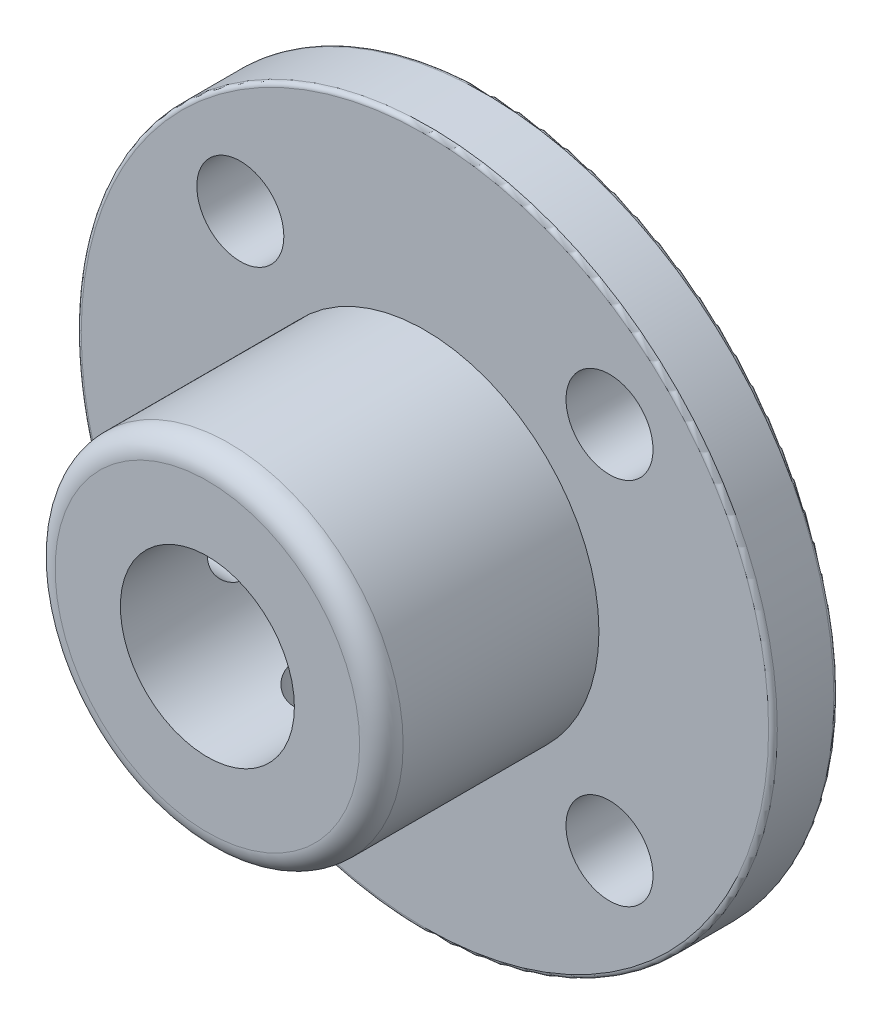
ISO-10303-21;
HEADER;
FILE_DESCRIPTION(('STEP AP214'),'2;1');
FILE_NAME('part.step','',(''),(''),'','','');
FILE_SCHEMA(('AUTOMOTIVE_DESIGN { 1 0 10303 214 1 1 1 1 }'));
ENDSEC;
DATA;
#1=APPLICATION_CONTEXT('core data for automotive mechanical design processes');
#2=APPLICATION_PROTOCOL_DEFINITION('international standard','automotive_design',2000,#1);
#3=PRODUCT_CONTEXT('',#1,'mechanical');
#4=PRODUCT('Part','Part','',(#3));
#5=PRODUCT_RELATED_PRODUCT_CATEGORY('part','',(#4));
#6=PRODUCT_DEFINITION_FORMATION('','',#4);
#7=PRODUCT_DEFINITION_CONTEXT('part definition',#1,'design');
#8=PRODUCT_DEFINITION('design','',#6,#7);
#9=PRODUCT_DEFINITION_SHAPE('','',#8);
#10=(LENGTH_UNIT() NAMED_UNIT(*) SI_UNIT(.MILLI.,.METRE.));
#11=(NAMED_UNIT(*) PLANE_ANGLE_UNIT() SI_UNIT($,.RADIAN.));
#12=(NAMED_UNIT(*) SI_UNIT($,.STERADIAN.) SOLID_ANGLE_UNIT());
#13=UNCERTAINTY_MEASURE_WITH_UNIT(LENGTH_MEASURE(1.E-05),#10,'distance_accuracy_value','');
#14=(GEOMETRIC_REPRESENTATION_CONTEXT(3) GLOBAL_UNCERTAINTY_ASSIGNED_CONTEXT((#13)) GLOBAL_UNIT_ASSIGNED_CONTEXT((#10,
#11,#12)) REPRESENTATION_CONTEXT('',''));
#15=CARTESIAN_POINT('',(0.,0.,0.));
#16=DIRECTION('',(0.,0.,1.));
#17=DIRECTION('',(1.,0.,0.));
#18=AXIS2_PLACEMENT_3D('',#15,#16,#17);
#19=CARTESIAN_POINT('',(0.,0.,3.));
#20=DIRECTION('',(0.,0.,-1.));
#21=DIRECTION('',(-1.,0.,0.));
#22=AXIS2_PLACEMENT_3D('',#19,#20,#21);
#23=CYLINDRICAL_SURFACE('',#22,16.);
#24=CARTESIAN_POINT('',(0.,0.,0.2));
#25=DIRECTION('',(0.,0.,1.));
#26=DIRECTION('',(1.,0.,0.));
#27=AXIS2_PLACEMENT_3D('',#24,#25,#26);
#28=CIRCLE('',#27,16.);
#29=CARTESIAN_POINT('',(16.,0.,0.2));
#30=VERTEX_POINT('',#29);
#31=EDGE_CURVE('E44',#30,#30,#28,.T.);
#32=ORIENTED_EDGE('',*,*,#31,.T.);
#33=EDGE_LOOP('',(#32));
#34=FACE_BOUND('',#33,.T.);
#35=CARTESIAN_POINT('',(0.,0.,2.8));
#36=DIRECTION('',(0.,0.,1.));
#37=DIRECTION('',(1.,0.,0.));
#38=AXIS2_PLACEMENT_3D('',#35,#36,#37);
#39=CIRCLE('',#38,16.);
#40=CARTESIAN_POINT('',(16.,0.,2.8));
#41=VERTEX_POINT('',#40);
#42=EDGE_CURVE('E48',#41,#41,#39,.F.);
#43=ORIENTED_EDGE('',*,*,#42,.T.);
#44=EDGE_LOOP('',(#43));
#45=FACE_BOUND('',#44,.T.);
#46=ADVANCED_FACE('F33',(#34,#45),#23,.T.);
#47=CARTESIAN_POINT('',(0.,0.,3.));
#48=DIRECTION('',(0.,0.,1.));
#49=DIRECTION('',(1.,0.,0.));
#50=AXIS2_PLACEMENT_3D('',#47,#48,#49);
#51=PLANE('',#50);
#52=CARTESIAN_POINT('',(0.,0.,3.));
#53=DIRECTION('',(0.,0.,1.));
#54=DIRECTION('',(1.,0.,0.));
#55=AXIS2_PLACEMENT_3D('',#52,#53,#54);
#56=CIRCLE('',#55,15.8);
#57=CARTESIAN_POINT('',(15.8,0.,3.));
#58=VERTEX_POINT('',#57);
#59=EDGE_CURVE('E10',#58,#58,#56,.T.);
#60=ORIENTED_EDGE('',*,*,#59,.T.);
#61=EDGE_LOOP('',(#60));
#62=FACE_BOUND('',#61,.T.);
#63=CARTESIAN_POINT('',(-8.48528137423857,-8.48528137423857,3.));
#64=DIRECTION('',(0.,0.,1.));
#65=DIRECTION('',(1.,0.,0.));
#66=AXIS2_PLACEMENT_3D('',#63,#64,#65);
#67=CIRCLE('',#66,2.);
#68=CARTESIAN_POINT('',(-6.48528137423857,-8.48528137423857,3.));
#69=VERTEX_POINT('',#68);
#70=EDGE_CURVE('E272',#69,#69,#67,.T.);
#71=ORIENTED_EDGE('',*,*,#70,.F.);
#72=EDGE_LOOP('',(#71));
#73=FACE_BOUND('',#72,.T.);
#74=CARTESIAN_POINT('',(8.48528137423857,-8.48528137423857,3.));
#75=DIRECTION('',(0.,0.,1.));
#76=DIRECTION('',(1.,0.,0.));
#77=AXIS2_PLACEMENT_3D('',#74,#75,#76);
#78=CIRCLE('',#77,2.);
#79=CARTESIAN_POINT('',(10.4852813742386,-8.48528137423857,3.));
#80=VERTEX_POINT('',#79);
#81=EDGE_CURVE('E278',#80,#80,#78,.T.);
#82=ORIENTED_EDGE('',*,*,#81,.F.);
#83=EDGE_LOOP('',(#82));
#84=FACE_BOUND('',#83,.T.);
#85=CARTESIAN_POINT('',(8.48528137423857,8.48528137423857,3.));
#86=DIRECTION('',(0.,0.,1.));
#87=DIRECTION('',(1.,0.,0.));
#88=AXIS2_PLACEMENT_3D('',#85,#86,#87);
#89=CIRCLE('',#88,2.);
#90=CARTESIAN_POINT('',(10.4852813742386,8.48528137423857,3.));
#91=VERTEX_POINT('',#90);
#92=EDGE_CURVE('E245',#91,#91,#89,.T.);
#93=ORIENTED_EDGE('',*,*,#92,.F.);
#94=EDGE_LOOP('',(#93));
#95=FACE_BOUND('',#94,.T.);
#96=CARTESIAN_POINT('',(-8.48528137423857,8.48528137423857,3.));
#97=DIRECTION('',(0.,0.,1.));
#98=DIRECTION('',(1.,0.,0.));
#99=AXIS2_PLACEMENT_3D('',#96,#97,#98);
#100=CIRCLE('',#99,2.);
#101=CARTESIAN_POINT('',(-6.48528137423857,8.48528137423857,3.));
#102=VERTEX_POINT('',#101);
#103=EDGE_CURVE('E238',#102,#102,#100,.T.);
#104=ORIENTED_EDGE('',*,*,#103,.F.);
#105=EDGE_LOOP('',(#104));
#106=FACE_BOUND('',#105,.T.);
#107=CARTESIAN_POINT('',(0.,0.,3.));
#108=DIRECTION('',(0.,0.,1.));
#109=DIRECTION('',(1.,0.,0.));
#110=AXIS2_PLACEMENT_3D('',#107,#108,#109);
#111=CIRCLE('',#110,8.);
#112=CARTESIAN_POINT('',(8.,0.,3.));
#113=VERTEX_POINT('',#112);
#114=EDGE_CURVE('E251',#113,#113,#111,.T.);
#115=ORIENTED_EDGE('',*,*,#114,.F.);
#116=EDGE_LOOP('',(#115));
#117=FACE_BOUND('',#116,.T.);
#118=ADVANCED_FACE('F101',(#62,#73,#84,#95,#106,#117),#51,.T.);
#119=CARTESIAN_POINT('',(0.,0.,0.));
#120=DIRECTION('',(0.,0.,1.));
#121=DIRECTION('',(1.,0.,0.));
#122=AXIS2_PLACEMENT_3D('',#119,#120,#121);
#123=PLANE('',#122);
#124=CARTESIAN_POINT('',(0.,0.,0.));
#125=DIRECTION('',(0.,0.,1.));
#126=DIRECTION('',(1.,0.,0.));
#127=AXIS2_PLACEMENT_3D('',#124,#125,#126);
#128=CIRCLE('',#127,15.8);
#129=CARTESIAN_POINT('',(15.8,0.,0.));
#130=VERTEX_POINT('',#129);
#131=EDGE_CURVE('E40',#130,#130,#128,.F.);
#132=ORIENTED_EDGE('',*,*,#131,.T.);
#133=EDGE_LOOP('',(#132));
#134=FACE_BOUND('',#133,.T.);
#135=CARTESIAN_POINT('',(-8.48528137423857,-8.48528137423857,0.));
#136=DIRECTION('',(0.,0.,1.));
#137=DIRECTION('',(1.,0.,0.));
#138=AXIS2_PLACEMENT_3D('',#135,#136,#137);
#139=CIRCLE('',#138,2.);
#140=CARTESIAN_POINT('',(-6.48528137423857,-8.48528137423857,0.));
#141=VERTEX_POINT('',#140);
#142=EDGE_CURVE('E275',#141,#141,#139,.T.);
#143=ORIENTED_EDGE('',*,*,#142,.T.);
#144=EDGE_LOOP('',(#143));
#145=FACE_BOUND('',#144,.T.);
#146=CARTESIAN_POINT('',(8.48528137423857,-8.48528137423857,0.));
#147=DIRECTION('',(0.,0.,1.));
#148=DIRECTION('',(1.,0.,0.));
#149=AXIS2_PLACEMENT_3D('',#146,#147,#148);
#150=CIRCLE('',#149,2.);
#151=CARTESIAN_POINT('',(10.4852813742386,-8.48528137423857,0.));
#152=VERTEX_POINT('',#151);
#153=EDGE_CURVE('E281',#152,#152,#150,.T.);
#154=ORIENTED_EDGE('',*,*,#153,.T.);
#155=EDGE_LOOP('',(#154));
#156=FACE_BOUND('',#155,.T.);
#157=CARTESIAN_POINT('',(8.48528137423857,8.48528137423857,0.));
#158=DIRECTION('',(0.,0.,1.));
#159=DIRECTION('',(1.,0.,0.));
#160=AXIS2_PLACEMENT_3D('',#157,#158,#159);
#161=CIRCLE('',#160,2.);
#162=CARTESIAN_POINT('',(10.4852813742386,8.48528137423857,0.));
#163=VERTEX_POINT('',#162);
#164=EDGE_CURVE('E240',#163,#163,#161,.T.);
#165=ORIENTED_EDGE('',*,*,#164,.T.);
#166=EDGE_LOOP('',(#165));
#167=FACE_BOUND('',#166,.T.);
#168=CARTESIAN_POINT('',(-8.48528137423857,8.48528137423857,0.));
#169=DIRECTION('',(0.,0.,1.));
#170=DIRECTION('',(1.,0.,0.));
#171=AXIS2_PLACEMENT_3D('',#168,#169,#170);
#172=CIRCLE('',#171,2.);
#173=CARTESIAN_POINT('',(-6.48528137423857,8.48528137423857,0.));
#174=VERTEX_POINT('',#173);
#175=EDGE_CURVE('E235',#174,#174,#172,.T.);
#176=ORIENTED_EDGE('',*,*,#175,.T.);
#177=EDGE_LOOP('',(#176));
#178=FACE_BOUND('',#177,.T.);
#179=CARTESIAN_POINT('',(0.,0.,0.));
#180=DIRECTION('',(0.,0.,1.));
#181=DIRECTION('',(1.,0.,0.));
#182=AXIS2_PLACEMENT_3D('',#179,#180,#181);
#183=CIRCLE('',#182,4.);
#184=CARTESIAN_POINT('',(4.,0.,0.));
#185=VERTEX_POINT('',#184);
#186=EDGE_CURVE('E248',#185,#185,#183,.T.);
#187=ORIENTED_EDGE('',*,*,#186,.T.);
#188=EDGE_LOOP('',(#187));
#189=FACE_BOUND('',#188,.T.);
#190=ADVANCED_FACE('F99',(#134,#145,#156,#167,#178,#189),#123,.F.);
#191=CARTESIAN_POINT('',(0.,0.,13.));
#192=DIRECTION('',(0.,0.,-1.));
#193=DIRECTION('',(-1.,0.,0.));
#194=AXIS2_PLACEMENT_3D('',#191,#192,#193);
#195=CYLINDRICAL_SURFACE('',#194,8.);
#196=CARTESIAN_POINT('',(0.,-8.,9.));
#197=CARTESIAN_POINT('',(0.0834717464654709,-7.99999848833852,8.99999681041172));
#198=CARTESIAN_POINT('',(0.166984992730099,-7.99868009921714,8.99300892338062));
#199=CARTESIAN_POINT('',(0.331658129841797,-7.9935478589052,8.96526000488165));
#200=CARTESIAN_POINT('',(0.412815974152225,-7.98973190166897,8.94448734936027));
#201=CARTESIAN_POINT('',(0.570372961851801,-7.98003138765458,8.88982729874066));
#202=CARTESIAN_POINT('',(0.646776330685344,-7.97414869946483,8.85595174754746));
#203=CARTESIAN_POINT('',(0.792807973094007,-7.96095710599783,8.77608112307718));
#204=CARTESIAN_POINT('',(0.862436794477323,-7.9536483161829,8.73008703085518));
#205=CARTESIAN_POINT('',(0.993783715930502,-7.93831336430504,8.62670023199632));
#206=CARTESIAN_POINT('',(1.05540895503183,-7.93028034856351,8.56919055532986));
#207=CARTESIAN_POINT('',(1.16819606135369,-7.9144531845865,8.44465669091244));
#208=CARTESIAN_POINT('',(1.21935717689241,-7.90665905354527,8.37763182023071));
#209=CARTESIAN_POINT('',(1.31014998665793,-7.89212551245005,8.23531391163603));
#210=CARTESIAN_POINT('',(1.34968721969605,-7.88539493886182,8.15995962968276));
#211=CARTESIAN_POINT('',(1.41550524332283,-7.87384713211987,8.00353108482321));
#212=CARTESIAN_POINT('',(1.44178717713098,-7.86902973396962,7.92245731588878));
#213=CARTESIAN_POINT('',(1.480050535035,-7.8619226957455,7.75788476908559));
#214=CARTESIAN_POINT('',(1.49219390192039,-7.85960445366405,7.67442490279654));
#215=CARTESIAN_POINT('',(1.50233808095346,-7.85767197152761,7.50662261519175));
#216=CARTESIAN_POINT('',(1.50034016135374,-7.8580574889876,7.4222802736977));
#217=CARTESIAN_POINT('',(1.48238979602362,-7.86146292701753,7.25628047473395));
#218=CARTESIAN_POINT('',(1.46662149996045,-7.86444808147334,7.17460228569985));
#219=CARTESIAN_POINT('',(1.42186799396207,-7.87266183284666,7.01507158021739));
#220=CARTESIAN_POINT('',(1.39288222239499,-7.87789052509516,6.9372192264907));
#221=CARTESIAN_POINT('',(1.322336471793,-7.89003855292588,6.78701132099974));
#222=CARTESIAN_POINT('',(1.28070213532456,-7.89696783823366,6.71469152941919));
#223=CARTESIAN_POINT('',(1.18609368930416,-7.91172971602918,6.57799527145977));
#224=CARTESIAN_POINT('',(1.13311842889266,-7.91956240015522,6.5136196122852));
#225=CARTESIAN_POINT('',(1.01633905685298,-7.93540001272164,6.39357504432754));
#226=CARTESIAN_POINT('',(0.952377436860683,-7.9434057102403,6.33805934754826));
#227=CARTESIAN_POINT('',(0.815968037098827,-7.95857386108318,6.23852275932459));
#228=CARTESIAN_POINT('',(0.74352017225577,-7.96573630595245,6.19450198312958));
#229=CARTESIAN_POINT('',(0.592034988874669,-7.97842539677509,6.11918224612998));
#230=CARTESIAN_POINT('',(0.512989564446494,-7.98394999136289,6.0878992208821));
#231=CARTESIAN_POINT('',(0.350639115398697,-7.99272505402719,6.03909790690784));
#232=CARTESIAN_POINT('',(0.267334544277787,-7.99597576367994,6.02157815595464));
#233=CARTESIAN_POINT('',(0.100148652903386,-7.99980360641981,6.00101396898173));
#234=CARTESIAN_POINT('',(0.0162940126341359,-8.00041950912279,5.99775960847027));
#235=CARTESIAN_POINT('',(-0.150761248092183,-7.99901543598228,6.00525547954765));
#236=CARTESIAN_POINT('',(-0.233961900480385,-7.99699558964431,6.01600502306526));
#237=CARTESIAN_POINT('',(-0.396681573218217,-7.99057111500406,6.05102903518337));
#238=CARTESIAN_POINT('',(-0.476224261046063,-7.98618522374031,6.07519728253781));
#239=CARTESIAN_POINT('',(-0.630128631824633,-7.97551842212498,6.13625770677879));
#240=CARTESIAN_POINT('',(-0.704489962595103,-7.96923738311334,6.17315074756578));
#241=CARTESIAN_POINT('',(-0.846816671513214,-7.95538030357666,6.25907812815951));
#242=CARTESIAN_POINT('',(-0.914703277015121,-7.94779086174563,6.30824073853684));
#243=CARTESIAN_POINT('',(-1.04133832326455,-7.93219343489712,6.41713813736236));
#244=CARTESIAN_POINT('',(-1.10008590976087,-7.92418541084687,6.47687391300133));
#245=CARTESIAN_POINT('',(-1.20757295872048,-7.9085247569745,6.60617231891143));
#246=CARTESIAN_POINT('',(-1.25616916218577,-7.90087825860257,6.67585490812539));
#247=CARTESIAN_POINT('',(-1.34096675057787,-7.88692985578532,6.82251762452375));
#248=CARTESIAN_POINT('',(-1.37716859613924,-7.8806279013735,6.89949748037047));
#249=CARTESIAN_POINT('',(-1.43594673512823,-7.87013024209574,7.05820586724254));
#250=CARTESIAN_POINT('',(-1.45858868794786,-7.86592440436878,7.13990937955933));
#251=CARTESIAN_POINT('',(-1.48980679326235,-7.86007203802415,7.3060472225214));
#252=CARTESIAN_POINT('',(-1.49838453270708,-7.8584252206579,7.3904812439704));
#253=CARTESIAN_POINT('',(-1.50117762148355,-7.85789199803857,7.55824833144151));
#254=CARTESIAN_POINT('',(-1.49561895003499,-7.85896215974293,7.64157758095699));
#255=CARTESIAN_POINT('',(-1.47079175378803,-7.86364600659998,7.80609142204529));
#256=CARTESIAN_POINT('',(-1.45152331089332,-7.86725967655747,7.88727602642744));
#257=CARTESIAN_POINT('',(-1.39991887583263,-7.8766050802318,8.04507448479548));
#258=CARTESIAN_POINT('',(-1.36760735397252,-7.88233284594965,8.12169659134577));
#259=CARTESIAN_POINT('',(-1.29085868912204,-7.8952638755184,8.26846825424084));
#260=CARTESIAN_POINT('',(-1.24642068948186,-7.90246724360119,8.33861735284478));
#261=CARTESIAN_POINT('',(-1.14589487339535,-7.91767266107745,8.4715836800423));
#262=CARTESIAN_POINT('',(-1.08964259864303,-7.92568505353043,8.5342754125671));
#263=CARTESIAN_POINT('',(-0.96742792674229,-7.94152833918735,8.64940516246452));
#264=CARTESIAN_POINT('',(-0.901463301891615,-7.94935919027328,8.70184082098014));
#265=CARTESIAN_POINT('',(-0.760984945071872,-7.96403975968049,8.79541095262706));
#266=CARTESIAN_POINT('',(-0.686399590640516,-7.97088000990561,8.83643942849064));
#267=CARTESIAN_POINT('',(-0.531290113653833,-7.98271619380687,8.90531763660514));
#268=CARTESIAN_POINT('',(-0.450771651705247,-7.98771385879037,8.93317974704691));
#269=CARTESIAN_POINT('',(-0.308347202825153,-7.99428290707632,8.96927731441867));
#270=CARTESIAN_POINT('',(-0.24727381025187,-7.99641470878206,8.9807786303128));
#271=CARTESIAN_POINT('',(-0.124141247115158,-7.9992737995401,8.99614106211645));
#272=CARTESIAN_POINT('',(-0.0620821016527095,-8.00000112429805,9.00000237225591));
#273=CARTESIAN_POINT('',(0.,-8.,9.));
#274=B_SPLINE_CURVE_WITH_KNOTS('',3,(#196,#197,#198,#199,#200,#201,#202,#203,#204,#205,#206,
#207,#208,#209,#210,#211,#212,#213,#214,#215,#216,#217,#218,#219,#220,#221,#222,#223,#224,#225,
#226,#227,#228,#229,#230,#231,#232,#233,#234,#235,#236,#237,#238,#239,#240,#241,#242,#243,#244,
#245,#246,#247,#248,#249,#250,#251,#252,#253,#254,#255,#256,#257,#258,#259,#260,#261,#262,#263,
#264,#265,#266,#267,#268,#269,#270,#271,#272,#273),.UNSPECIFIED.,.T.,.F.,(4,2,2,2,2,2,2,2,2,2,2,
2,2,2,2,2,2,2,2,2,2,2,2,2,2,2,2,2,2,2,2,2,2,2,2,2,2,2,4),(0.,0.250188200964924,
0.500587642535452,0.750761271230907,1.00091465336891,1.2537511801363,1.50660586283617,
1.76146190504357,2.01629596311948,2.26818151445336,2.52004447587256,2.76859000612765,
3.01714609846786,3.2671926262953,3.51726454049859,3.77127768464077,4.02529337544948,
4.27962588321699,4.53393136673745,4.78448174076097,5.03501980464583,5.28360233907828,
5.53220175338032,5.78351778017708,6.03485728413098,6.28953436987299,6.54420198954945,
6.79762627818559,7.05102196946513,7.30039252231748,7.54976158541506,7.79866496207692,
8.04758592655423,8.3002336996638,8.55293951262255,8.80792048916315,9.06266126931173,
9.24874344524409,9.43482089039541),.UNSPECIFIED.);
#275=CARTESIAN_POINT('',(0.,-8.,9.));
#276=VERTEX_POINT('',#275);
#277=EDGE_CURVE('E62',#276,#276,#274,.T.);
#278=ORIENTED_EDGE('',*,*,#277,.T.);
#279=EDGE_LOOP('',(#278));
#280=FACE_BOUND('',#279,.T.);
#281=CARTESIAN_POINT('',(-8.,0.,9.));
#282=CARTESIAN_POINT('',(-7.99999848833852,-0.0834717464654709,8.99999681041172));
#283=CARTESIAN_POINT('',(-7.99868009921714,-0.166984992730099,8.99300892338062));
#284=CARTESIAN_POINT('',(-7.9935478589052,-0.331658129841798,8.96526000488165));
#285=CARTESIAN_POINT('',(-7.98973190166897,-0.412815974152226,8.94448734936027));
#286=CARTESIAN_POINT('',(-7.98003138765458,-0.570372961851802,8.88982729874066));
#287=CARTESIAN_POINT('',(-7.97414869946483,-0.646776330685345,8.85595174754746));
#288=CARTESIAN_POINT('',(-7.96095710599783,-0.792807973094008,8.77608112307718));
#289=CARTESIAN_POINT('',(-7.9536483161829,-0.862436794477324,8.73008703085518));
#290=CARTESIAN_POINT('',(-7.93831336430504,-0.993783715930504,8.62670023199632));
#291=CARTESIAN_POINT('',(-7.93028034856351,-1.05540895503183,8.56919055532986));
#292=CARTESIAN_POINT('',(-7.9144531845865,-1.16819606135369,8.44465669091244));
#293=CARTESIAN_POINT('',(-7.90665905354527,-1.21935717689242,8.37763182023071));
#294=CARTESIAN_POINT('',(-7.89212551245005,-1.31014998665793,8.23531391163603));
#295=CARTESIAN_POINT('',(-7.88539493886182,-1.34968721969606,8.15995962968276));
#296=CARTESIAN_POINT('',(-7.87384713211987,-1.41550524332283,8.00353108482321));
#297=CARTESIAN_POINT('',(-7.86902973396962,-1.44178717713098,7.92245731588878));
#298=CARTESIAN_POINT('',(-7.8619226957455,-1.480050535035,7.75788476908559));
#299=CARTESIAN_POINT('',(-7.85960445366405,-1.49219390192039,7.67442490279653));
#300=CARTESIAN_POINT('',(-7.85767197152761,-1.50233808095347,7.50662261519175));
#301=CARTESIAN_POINT('',(-7.8580574889876,-1.50034016135374,7.4222802736977));
#302=CARTESIAN_POINT('',(-7.86146292701753,-1.48238979602363,7.25628047473395));
#303=CARTESIAN_POINT('',(-7.86444808147334,-1.46662149996045,7.17460228569985));
#304=CARTESIAN_POINT('',(-7.87266183284666,-1.42186799396207,7.01507158021739));
#305=CARTESIAN_POINT('',(-7.87789052509516,-1.392882222395,6.9372192264907));
#306=CARTESIAN_POINT('',(-7.89003855292588,-1.322336471793,6.78701132099974));
#307=CARTESIAN_POINT('',(-7.89696783823366,-1.28070213532456,6.71469152941919));
#308=CARTESIAN_POINT('',(-7.91172971602918,-1.18609368930416,6.57799527145977));
#309=CARTESIAN_POINT('',(-7.91956240015522,-1.13311842889266,6.5136196122852));
#310=CARTESIAN_POINT('',(-7.93540001272164,-1.01633905685298,6.39357504432754));
#311=CARTESIAN_POINT('',(-7.94340571024031,-0.952377436860685,6.33805934754826));
#312=CARTESIAN_POINT('',(-7.95857386108318,-0.815968037098829,6.23852275932459));
#313=CARTESIAN_POINT('',(-7.96573630595245,-0.743520172255772,6.19450198312958));
#314=CARTESIAN_POINT('',(-7.97842539677509,-0.592034988874671,6.11918224612998));
#315=CARTESIAN_POINT('',(-7.98394999136289,-0.512989564446497,6.0878992208821));
#316=CARTESIAN_POINT('',(-7.99272505402719,-0.350639115398699,6.03909790690784));
#317=CARTESIAN_POINT('',(-7.99597576367994,-0.26733454427779,6.02157815595464));
#318=CARTESIAN_POINT('',(-7.99980360641981,-0.100148652903388,6.00101396898173));
#319=CARTESIAN_POINT('',(-8.00041950912279,-0.0162940126341377,5.99775960847027));
#320=CARTESIAN_POINT('',(-7.99901543598228,0.150761248092182,6.00525547954765));
#321=CARTESIAN_POINT('',(-7.99699558964431,0.233961900480383,6.01600502306526));
#322=CARTESIAN_POINT('',(-7.99057111500406,0.396681573218215,6.05102903518337));
#323=CARTESIAN_POINT('',(-7.98618522374031,0.476224261046061,6.07519728253781));
#324=CARTESIAN_POINT('',(-7.97551842212498,0.630128631824631,6.13625770677878));
#325=CARTESIAN_POINT('',(-7.96923738311334,0.704489962595101,6.17315074756578));
#326=CARTESIAN_POINT('',(-7.95538030357666,0.846816671513212,6.25907812815951));
#327=CARTESIAN_POINT('',(-7.94779086174563,0.914703277015119,6.30824073853684));
#328=CARTESIAN_POINT('',(-7.93219343489712,1.04133832326454,6.41713813736236));
#329=CARTESIAN_POINT('',(-7.92418541084687,1.10008590976086,6.47687391300133));
#330=CARTESIAN_POINT('',(-7.9085247569745,1.20757295872048,6.60617231891142));
#331=CARTESIAN_POINT('',(-7.90087825860257,1.25616916218576,6.67585490812538));
#332=CARTESIAN_POINT('',(-7.88692985578532,1.34096675057787,6.82251762452375));
#333=CARTESIAN_POINT('',(-7.8806279013735,1.37716859613924,6.89949748037047));
#334=CARTESIAN_POINT('',(-7.87013024209574,1.43594673512823,7.05820586724254));
#335=CARTESIAN_POINT('',(-7.86592440436878,1.45858868794786,7.13990937955933));
#336=CARTESIAN_POINT('',(-7.86007203802415,1.48980679326235,7.3060472225214));
#337=CARTESIAN_POINT('',(-7.8584252206579,1.49838453270708,7.3904812439704));
#338=CARTESIAN_POINT('',(-7.85789199803857,1.50117762148355,7.55824833144151));
#339=CARTESIAN_POINT('',(-7.85896215974293,1.49561895003499,7.64157758095699));
#340=CARTESIAN_POINT('',(-7.86364600659998,1.47079175378803,7.80609142204529));
#341=CARTESIAN_POINT('',(-7.86725967655747,1.45152331089332,7.88727602642744));
#342=CARTESIAN_POINT('',(-7.8766050802318,1.39991887583263,8.04507448479548));
#343=CARTESIAN_POINT('',(-7.88233284594965,1.36760735397252,8.12169659134577));
#344=CARTESIAN_POINT('',(-7.8952638755184,1.29085868912204,8.26846825424084));
#345=CARTESIAN_POINT('',(-7.90246724360119,1.24642068948186,8.33861735284478));
#346=CARTESIAN_POINT('',(-7.91767266107745,1.14589487339535,8.47158368004229));
#347=CARTESIAN_POINT('',(-7.92568505353043,1.08964259864303,8.5342754125671));
#348=CARTESIAN_POINT('',(-7.94152833918735,0.967427926742289,8.64940516246452));
#349=CARTESIAN_POINT('',(-7.94935919027328,0.901463301891614,8.70184082098013));
#350=CARTESIAN_POINT('',(-7.96403975968049,0.760984945071871,8.79541095262706));
#351=CARTESIAN_POINT('',(-7.97088000990561,0.686399590640515,8.83643942849064));
#352=CARTESIAN_POINT('',(-7.98271619380687,0.531290113653832,8.90531763660513));
#353=CARTESIAN_POINT('',(-7.98771385879037,0.450771651705246,8.93317974704691));
#354=CARTESIAN_POINT('',(-7.99428290707632,0.308347202825153,8.96927731441867));
#355=CARTESIAN_POINT('',(-7.99641470878206,0.24727381025187,8.9807786303128));
#356=CARTESIAN_POINT('',(-7.9992737995401,0.124141247115158,8.99614106211645));
#357=CARTESIAN_POINT('',(-8.00000112429805,0.0620821016527094,9.00000237225591));
#358=CARTESIAN_POINT('',(-8.,0.,9.));
#359=B_SPLINE_CURVE_WITH_KNOTS('',3,(#281,#282,#283,#284,#285,#286,#287,#288,#289,#290,#291,
#292,#293,#294,#295,#296,#297,#298,#299,#300,#301,#302,#303,#304,#305,#306,#307,#308,#309,#310,
#311,#312,#313,#314,#315,#316,#317,#318,#319,#320,#321,#322,#323,#324,#325,#326,#327,#328,#329,
#330,#331,#332,#333,#334,#335,#336,#337,#338,#339,#340,#341,#342,#343,#344,#345,#346,#347,#348,
#349,#350,#351,#352,#353,#354,#355,#356,#357,#358),.UNSPECIFIED.,.T.,.F.,(4,2,2,2,2,2,2,2,2,2,2,
2,2,2,2,2,2,2,2,2,2,2,2,2,2,2,2,2,2,2,2,2,2,2,2,2,2,2,4),(0.,0.250188200964924,
0.500587642535452,0.750761271230908,1.00091465336891,1.25375118013631,1.50660586283617,
1.76146190504358,2.01629596311949,2.26818151445336,2.52004447587256,2.76859000612766,
3.01714609846787,3.26719262629531,3.5172645404986,3.77127768464077,4.02529337544948,
4.27962588321699,4.53393136673746,4.78448174076097,5.03501980464584,5.28360233907829,
5.53220175338032,5.78351778017709,6.03485728413099,6.28953436987299,6.54420198954945,
6.79762627818559,7.05102196946513,7.30039252231748,7.54976158541507,7.79866496207693,
8.04758592655423,8.30023369966381,8.55293951262256,8.80792048916315,9.06266126931174,
9.2487434452441,9.43482089039541),.UNSPECIFIED.);
#360=CARTESIAN_POINT('',(-8.,0.,9.));
#361=VERTEX_POINT('',#360);
#362=EDGE_CURVE('E89',#361,#361,#359,.T.);
#363=ORIENTED_EDGE('',*,*,#362,.T.);
#364=EDGE_LOOP('',(#363));
#365=FACE_BOUND('',#364,.T.);
#366=CARTESIAN_POINT('',(0.,0.,12.));
#367=DIRECTION('',(0.,0.,1.));
#368=DIRECTION('',(1.,0.,0.));
#369=AXIS2_PLACEMENT_3D('',#366,#367,#368);
#370=CIRCLE('',#369,8.);
#371=CARTESIAN_POINT('',(8.,0.,12.));
#372=VERTEX_POINT('',#371);
#373=EDGE_CURVE('E53',#372,#372,#370,.F.);
#374=ORIENTED_EDGE('',*,*,#373,.T.);
#375=EDGE_LOOP('',(#374));
#376=FACE_BOUND('',#375,.T.);
#377=ORIENTED_EDGE('',*,*,#114,.T.);
#378=EDGE_LOOP('',(#377));
#379=FACE_BOUND('',#378,.T.);
#380=ADVANCED_FACE('F94',(#280,#365,#376,#379),#195,.T.);
#381=CARTESIAN_POINT('',(0.,0.,13.));
#382=DIRECTION('',(0.,0.,1.));
#383=DIRECTION('',(1.,0.,0.));
#384=AXIS2_PLACEMENT_3D('',#381,#382,#383);
#385=PLANE('',#384);
#386=CARTESIAN_POINT('',(0.,0.,13.));
#387=DIRECTION('',(0.,0.,1.));
#388=DIRECTION('',(1.,0.,0.));
#389=AXIS2_PLACEMENT_3D('',#386,#387,#388);
#390=CIRCLE('',#389,7.);
#391=CARTESIAN_POINT('',(7.,0.,13.));
#392=VERTEX_POINT('',#391);
#393=EDGE_CURVE('E256',#392,#392,#390,.T.);
#394=ORIENTED_EDGE('',*,*,#393,.T.);
#395=EDGE_LOOP('',(#394));
#396=FACE_BOUND('',#395,.T.);
#397=CARTESIAN_POINT('',(0.,0.,13.));
#398=DIRECTION('',(0.,0.,1.));
#399=DIRECTION('',(1.,0.,0.));
#400=AXIS2_PLACEMENT_3D('',#397,#398,#399);
#401=CIRCLE('',#400,4.);
#402=CARTESIAN_POINT('',(4.,0.,13.));
#403=VERTEX_POINT('',#402);
#404=EDGE_CURVE('E242',#403,#403,#401,.T.);
#405=ORIENTED_EDGE('',*,*,#404,.F.);
#406=EDGE_LOOP('',(#405));
#407=FACE_BOUND('',#406,.T.);
#408=ADVANCED_FACE('F98',(#396,#407),#385,.T.);
#409=CARTESIAN_POINT('',(0.,0.,0.));
#410=DIRECTION('',(0.,0.,1.));
#411=DIRECTION('',(1.,0.,0.));
#412=AXIS2_PLACEMENT_3D('',#409,#410,#411);
#413=CYLINDRICAL_SURFACE('',#412,4.);
#414=CARTESIAN_POINT('',(0.,-4.,9.));
#415=CARTESIAN_POINT('',(-0.0812350589378528,-4.00000217456151,9.00000290230311));
#416=CARTESIAN_POINT('',(-0.162450241781792,-3.99750379283184,8.99338023975162));
#417=CARTESIAN_POINT('',(-0.322453452352361,-3.98778696006928,8.96717180473007));
#418=CARTESIAN_POINT('',(-0.401241827987616,-3.98056918893993,8.94758789952943));
#419=CARTESIAN_POINT('',(-0.554060784990878,-3.96218832391545,8.89624699822824));
#420=CARTESIAN_POINT('',(-0.628100224162277,-3.9510328434944,8.86451348317821));
#421=CARTESIAN_POINT('',(-0.769799310160253,-3.92588767765353,8.78989358698418));
#422=CARTESIAN_POINT('',(-0.837457239177879,-3.91189723227548,8.74700421445585));
#423=CARTESIAN_POINT('',(-0.967346417045825,-3.88186246971217,8.64938746892909));
#424=CARTESIAN_POINT('',(-1.02927073015119,-3.86576002583566,8.5942697377406));
#425=CARTESIAN_POINT('',(-1.14324421474363,-3.83360220871327,8.47458956534116));
#426=CARTESIAN_POINT('',(-1.19529036359203,-3.81754685135033,8.41002424391213));
#427=CARTESIAN_POINT('',(-1.28998202215985,-3.78662470617731,8.27028253247679));
#428=CARTESIAN_POINT('',(-1.3321939319576,-3.77182648820818,8.19479563345418));
#429=CARTESIAN_POINT('',(-1.40318646334084,-3.74599860237433,8.03715164583148));
#430=CARTESIAN_POINT('',(-1.43197244961239,-3.73496742975881,7.9549972368449));
#431=CARTESIAN_POINT('',(-1.47408431017549,-3.71854412824136,7.7898832597418));
#432=CARTESIAN_POINT('',(-1.48799593218558,-3.71293924350838,7.70709496156456));
#433=CARTESIAN_POINT('',(-1.50179556531648,-3.70738061461215,7.54018384200616));
#434=CARTESIAN_POINT('',(-1.50168936802631,-3.70742453659305,7.45606158612553));
#435=CARTESIAN_POINT('',(-1.48790429610018,-3.71297511632055,7.29423047478704));
#436=CARTESIAN_POINT('',(-1.47503808509003,-3.71815468871122,7.21643909395582));
#437=CARTESIAN_POINT('',(-1.4374416786833,-3.73284938059529,7.06421284959468));
#438=CARTESIAN_POINT('',(-1.41270969663258,-3.74236515298863,6.98977849338612));
#439=CARTESIAN_POINT('',(-1.35163748571904,-3.76485702190253,6.84472293227177));
#440=CARTESIAN_POINT('',(-1.31508648737101,-3.77789517988166,6.7742005138787));
#441=CARTESIAN_POINT('',(-1.23156073762698,-3.80594210139319,6.64005426240903));
#442=CARTESIAN_POINT('',(-1.18458238728897,-3.82095154457158,6.5764328224803));
#443=CARTESIAN_POINT('',(-1.07781780766549,-3.85248038859113,6.45339633634912));
#444=CARTESIAN_POINT('',(-1.01738298716956,-3.86903347455671,6.39455135925191));
#445=CARTESIAN_POINT('',(-0.887312590819021,-3.90091728164085,6.2876620337942));
#446=CARTESIAN_POINT('',(-0.817675603497364,-3.91624781465952,6.23961934539433));
#447=CARTESIAN_POINT('',(-0.669723436992419,-3.9442639480908,6.15506960293748));
#448=CARTESIAN_POINT('',(-0.591290713844719,-3.95690498259616,6.11875241877894));
#449=CARTESIAN_POINT('',(-0.428836850524583,-3.97778718326962,6.06001739572996));
#450=CARTESIAN_POINT('',(-0.344818210845767,-3.98603030341493,6.03759338343888));
#451=CARTESIAN_POINT('',(-0.178375243148665,-3.99684443228065,6.00837721245806));
#452=CARTESIAN_POINT('',(-0.0961036195622094,-3.99969369025686,6.00081739361749));
#453=CARTESIAN_POINT('',(0.0685724752550242,-4.00025893700126,5.99930893610008));
#454=CARTESIAN_POINT('',(0.150976912983373,-3.99797606386863,6.00535727968322));
#455=CARTESIAN_POINT('',(0.310262048561859,-3.98871709772643,6.03031004230867));
#456=CARTESIAN_POINT('',(0.387233328007336,-3.98192470962305,6.04871154373708));
#457=CARTESIAN_POINT('',(0.536941754957221,-3.96451477091717,6.09718607254732));
#458=CARTESIAN_POINT('',(0.609678350347534,-3.9538967228203,6.12726061794804));
#459=CARTESIAN_POINT('',(0.751247765110155,-3.92949624407681,6.19918641243948));
#460=CARTESIAN_POINT('',(0.819903083557795,-3.91563000209348,6.24135772922339));
#461=CARTESIAN_POINT('',(0.949392711726625,-3.88626671564664,6.33591810317156));
#462=CARTESIAN_POINT('',(1.01022412027045,-3.87076907009516,6.38831093254515));
#463=CARTESIAN_POINT('',(1.12603079874454,-3.8387332949099,6.50540412212427));
#464=CARTESIAN_POINT('',(1.18046154123569,-3.82218696503729,6.5706421827727));
#465=CARTESIAN_POINT('',(1.27771050031903,-3.79078815746854,6.70965138470766));
#466=CARTESIAN_POINT('',(1.32052767414518,-3.77593583194399,6.7834232913885));
#467=CARTESIAN_POINT('',(1.39337773518998,-3.74966829822463,6.93801598677231));
#468=CARTESIAN_POINT('',(1.42335685446918,-3.73826760328493,7.01886474591044));
#469=CARTESIAN_POINT('',(1.46907883466889,-3.72054032891005,7.18500976368782));
#470=CARTESIAN_POINT('',(1.48483050305535,-3.71421061057491,7.27030323619812));
#471=CARTESIAN_POINT('',(1.50086347097839,-3.70775894792573,7.43701615954112));
#472=CARTESIAN_POINT('',(1.50207331495837,-3.70726444523341,7.51833263171689));
#473=CARTESIAN_POINT('',(1.49136715641593,-3.71158412745292,7.67994531627617));
#474=CARTESIAN_POINT('',(1.47945239850124,-3.71639780898899,7.76024162467158));
#475=CARTESIAN_POINT('',(1.44355815630242,-3.73048141585432,7.91504722671655));
#476=CARTESIAN_POINT('',(1.41995798316524,-3.73961085376663,7.98965834624534));
#477=CARTESIAN_POINT('',(1.3616969677992,-3.76121548297845,8.13390550849442));
#478=CARTESIAN_POINT('',(1.32703332944945,-3.77369151995215,8.20354028807014));
#479=CARTESIAN_POINT('',(1.24552075938154,-3.80139723903965,8.33982678969763));
#480=CARTESIAN_POINT('',(1.1981283280301,-3.81673698440964,8.40613079679991));
#481=CARTESIAN_POINT('',(1.09334485729906,-3.84806246757177,8.5301415609712));
#482=CARTESIAN_POINT('',(1.03595064012808,-3.86404840943145,8.58784557478675));
#483=CARTESIAN_POINT('',(0.909080396784623,-3.89590424609881,8.69620195582184));
#484=CARTESIAN_POINT('',(0.839118644212992,-3.91172104900645,8.74630375343467));
#485=CARTESIAN_POINT('',(0.69121322320082,-3.94054514457031,8.83402265527656));
#486=CARTESIAN_POINT('',(0.613268934090621,-3.95355221851559,8.87163878773637));
#487=CARTESIAN_POINT('',(0.447999082002311,-3.9757429260668,8.93437682904833));
#488=CARTESIAN_POINT('',(0.360413422234207,-3.98473657158356,8.9588870646019));
#489=CARTESIAN_POINT('',(0.181875733606381,-3.99686242179587,8.99169295992068));
#490=CARTESIAN_POINT('',(0.0909254163648584,-3.99999756603967,8.99999675148732));
#491=CARTESIAN_POINT('',(0.,-4.,9.));
#492=B_SPLINE_CURVE_WITH_KNOTS('',3,(#414,#415,#416,#417,#418,#419,#420,#421,#422,#423,#424,
#425,#426,#427,#428,#429,#430,#431,#432,#433,#434,#435,#436,#437,#438,#439,#440,#441,#442,#443,
#444,#445,#446,#447,#448,#449,#450,#451,#452,#453,#454,#455,#456,#457,#458,#459,#460,#461,#462,
#463,#464,#465,#466,#467,#468,#469,#470,#471,#472,#473,#474,#475,#476,#477,#478,#479,#480,#481,
#482,#483,#484,#485,#486,#487,#488,#489,#490,#491),.UNSPECIFIED.,.T.,.F.,(4,2,2,2,2,2,2,2,2,2,2,
2,2,2,2,2,2,2,2,2,2,2,2,2,2,2,2,2,2,2,2,2,2,2,2,2,2,2,4),(0.,0.24336980156056,0.48670454953046,
0.729571369213572,0.972503379609489,1.22473618582715,1.47704604925622,1.73896674501658,
2.00078269352134,2.25185874416901,2.50283106079707,2.73878345119971,2.97477138060589,
3.21522408387018,3.45575990744258,3.71246153335813,3.96920257905066,4.22991375286075,
4.49050899698846,4.73725019635925,4.98393668390521,5.2211443792384,5.45838293254454,
5.702592218596,5.94689180019868,6.20536519455658,6.46386178920141,6.72343066727204,
6.98283874956507,7.22558763480252,7.46831350211259,7.70363142426533,7.93900886656506,
8.18672471884271,8.43451941997062,8.69572329654039,8.95694749805102,9.22948515032042,
9.50188601796127),.UNSPECIFIED.);
#493=CARTESIAN_POINT('',(0.,-4.,9.));
#494=VERTEX_POINT('',#493);
#495=EDGE_CURVE('E54',#494,#494,#492,.T.);
#496=ORIENTED_EDGE('',*,*,#495,.T.);
#497=EDGE_LOOP('',(#496));
#498=FACE_BOUND('',#497,.T.);
#499=CARTESIAN_POINT('',(-4.,0.,6.));
#500=CARTESIAN_POINT('',(-4.00000217456151,-0.0812350589378547,5.99999709769689));
#501=CARTESIAN_POINT('',(-3.99750379283184,-0.162450241781794,6.00661976024838));
#502=CARTESIAN_POINT('',(-3.98778696006928,-0.322453452352363,6.03282819526993));
#503=CARTESIAN_POINT('',(-3.98056918893993,-0.401241827987618,6.05241210047057));
#504=CARTESIAN_POINT('',(-3.96218832391545,-0.55406078499088,6.10375300177176));
#505=CARTESIAN_POINT('',(-3.9510328434944,-0.628100224162279,6.13548651682179));
#506=CARTESIAN_POINT('',(-3.92588767765353,-0.769799310160255,6.21010641301582));
#507=CARTESIAN_POINT('',(-3.91189723227548,-0.837457239177881,6.25299578554415));
#508=CARTESIAN_POINT('',(-3.88186246971217,-0.967346417045828,6.35061253107091));
#509=CARTESIAN_POINT('',(-3.86576002583566,-1.02927073015119,6.4057302622594));
#510=CARTESIAN_POINT('',(-3.83360220871327,-1.14324421474363,6.52541043465884));
#511=CARTESIAN_POINT('',(-3.81754685135033,-1.19529036359203,6.58997575608787));
#512=CARTESIAN_POINT('',(-3.78662470617731,-1.28998202215985,6.72971746752321));
#513=CARTESIAN_POINT('',(-3.77182648820818,-1.3321939319576,6.80520436654582));
#514=CARTESIAN_POINT('',(-3.74599860237433,-1.40318646334085,6.96284835416852));
#515=CARTESIAN_POINT('',(-3.73496742975881,-1.43197244961239,7.0450027631551));
#516=CARTESIAN_POINT('',(-3.71854412824136,-1.47408431017549,7.2101167402582));
#517=CARTESIAN_POINT('',(-3.71293924350838,-1.48799593218558,7.29290503843544));
#518=CARTESIAN_POINT('',(-3.70738061461215,-1.50179556531648,7.45981615799384));
#519=CARTESIAN_POINT('',(-3.70742453659305,-1.50168936802631,7.54393841387447));
#520=CARTESIAN_POINT('',(-3.71297511632054,-1.48790429610018,7.70576952521296));
#521=CARTESIAN_POINT('',(-3.71815468871122,-1.47503808509004,7.78356090604418));
#522=CARTESIAN_POINT('',(-3.73284938059529,-1.4374416786833,7.93578715040532));
#523=CARTESIAN_POINT('',(-3.74236515298863,-1.41270969663259,8.01022150661388));
#524=CARTESIAN_POINT('',(-3.76485702190253,-1.35163748571904,8.15527706772823));
#525=CARTESIAN_POINT('',(-3.77789517988166,-1.31508648737101,8.2257994861213));
#526=CARTESIAN_POINT('',(-3.80594210139319,-1.23156073762698,8.35994573759097));
#527=CARTESIAN_POINT('',(-3.82095154457158,-1.18458238728897,8.4235671775197));
#528=CARTESIAN_POINT('',(-3.85248038859113,-1.07781780766549,8.54660366365088));
#529=CARTESIAN_POINT('',(-3.86903347455671,-1.01738298716956,8.60544864074809));
#530=CARTESIAN_POINT('',(-3.90091728164086,-0.887312590819023,8.7123379662058));
#531=CARTESIAN_POINT('',(-3.91624781465952,-0.817675603497366,8.76038065460567));
#532=CARTESIAN_POINT('',(-3.9442639480908,-0.669723436992422,8.84493039706252));
#533=CARTESIAN_POINT('',(-3.95690498259616,-0.591290713844721,8.88124758122106));
#534=CARTESIAN_POINT('',(-3.97778718326962,-0.428836850524585,8.93998260427004));
#535=CARTESIAN_POINT('',(-3.98603030341493,-0.34481821084577,8.96240661656112));
#536=CARTESIAN_POINT('',(-3.99684443228065,-0.178375243148668,8.99162278754194));
#537=CARTESIAN_POINT('',(-3.99969369025686,-0.0961036195622118,8.99918260638251));
#538=CARTESIAN_POINT('',(-4.00025893700126,0.0685724752550221,9.00069106389992));
#539=CARTESIAN_POINT('',(-3.99797606386863,0.150976912983371,8.99464272031678));
#540=CARTESIAN_POINT('',(-3.98871709772643,0.310262048561858,8.96968995769133));
#541=CARTESIAN_POINT('',(-3.98192470962305,0.387233328007334,8.95128845626292));
#542=CARTESIAN_POINT('',(-3.96451477091717,0.536941754957219,8.90281392745268));
#543=CARTESIAN_POINT('',(-3.9538967228203,0.609678350347533,8.87273938205196));
#544=CARTESIAN_POINT('',(-3.92949624407682,0.751247765110154,8.80081358756052));
#545=CARTESIAN_POINT('',(-3.91563000209348,0.819903083557794,8.75864227077661));
#546=CARTESIAN_POINT('',(-3.88626671564664,0.949392711726624,8.66408189682844));
#547=CARTESIAN_POINT('',(-3.87076907009516,1.01022412027045,8.61168906745485));
#548=CARTESIAN_POINT('',(-3.8387332949099,1.12603079874454,8.49459587787572));
#549=CARTESIAN_POINT('',(-3.82218696503729,1.18046154123568,8.4293578172273));
#550=CARTESIAN_POINT('',(-3.79078815746854,1.27771050031903,8.29034861529234));
#551=CARTESIAN_POINT('',(-3.77593583194399,1.32052767414518,8.2165767086115));
#552=CARTESIAN_POINT('',(-3.74966829822463,1.39337773518998,8.06198401322769));
#553=CARTESIAN_POINT('',(-3.73826760328493,1.42335685446918,7.98113525408956));
#554=CARTESIAN_POINT('',(-3.72054032891005,1.46907883466889,7.81499023631218));
#555=CARTESIAN_POINT('',(-3.71421061057491,1.48483050305535,7.72969676380188));
#556=CARTESIAN_POINT('',(-3.70775894792573,1.50086347097839,7.56298384045888));
#557=CARTESIAN_POINT('',(-3.70726444523341,1.50207331495837,7.48166736828311));
#558=CARTESIAN_POINT('',(-3.71158412745292,1.49136715641593,7.32005468372383));
#559=CARTESIAN_POINT('',(-3.71639780898899,1.47945239850123,7.23975837532841));
#560=CARTESIAN_POINT('',(-3.73048141585432,1.44355815630241,7.08495277328345));
#561=CARTESIAN_POINT('',(-3.73961085376663,1.41995798316524,7.01034165375465));
#562=CARTESIAN_POINT('',(-3.76121548297845,1.36169696779919,6.86609449150558));
#563=CARTESIAN_POINT('',(-3.77369151995215,1.32703332944944,6.79645971192986));
#564=CARTESIAN_POINT('',(-3.80139723903965,1.24552075938153,6.66017321030237));
#565=CARTESIAN_POINT('',(-3.81673698440964,1.1981283280301,6.59386920320009));
#566=CARTESIAN_POINT('',(-3.84806246757177,1.09334485729906,6.46985843902879));
#567=CARTESIAN_POINT('',(-3.86404840943145,1.03595064012808,6.41215442521325));
#568=CARTESIAN_POINT('',(-3.89590424609881,0.90908039678462,6.30379804417816));
#569=CARTESIAN_POINT('',(-3.91172104900645,0.839118644212989,6.25369624656533));
#570=CARTESIAN_POINT('',(-3.94054514457031,0.691213223200818,6.16597734472344));
#571=CARTESIAN_POINT('',(-3.95355221851559,0.613268934090618,6.12836121226363));
#572=CARTESIAN_POINT('',(-3.9757429260668,0.44799908200231,6.06562317095167));
#573=CARTESIAN_POINT('',(-3.98473657158356,0.360413422234207,6.0411129353981));
#574=CARTESIAN_POINT('',(-3.99686242179587,0.181875733606381,6.00830704007932));
#575=CARTESIAN_POINT('',(-3.99999756603967,0.0909254163648574,6.00000324851267));
#576=CARTESIAN_POINT('',(-4.,0.,6.));
#577=B_SPLINE_CURVE_WITH_KNOTS('',3,(#499,#500,#501,#502,#503,#504,#505,#506,#507,#508,#509,
#510,#511,#512,#513,#514,#515,#516,#517,#518,#519,#520,#521,#522,#523,#524,#525,#526,#527,#528,
#529,#530,#531,#532,#533,#534,#535,#536,#537,#538,#539,#540,#541,#542,#543,#544,#545,#546,#547,
#548,#549,#550,#551,#552,#553,#554,#555,#556,#557,#558,#559,#560,#561,#562,#563,#564,#565,#566,
#567,#568,#569,#570,#571,#572,#573,#574,#575,#576),.UNSPECIFIED.,.T.,.F.,(4,2,2,2,2,2,2,2,2,2,2,
2,2,2,2,2,2,2,2,2,2,2,2,2,2,2,2,2,2,2,2,2,2,2,2,2,2,2,4),(0.,0.24336980156056,0.48670454953046,
0.729571369213573,0.97250337960949,1.22473618582715,1.47704604925622,1.73896674501659,
2.00078269352134,2.25185874416902,2.50283106079707,2.73878345119971,2.97477138060589,
3.21522408387018,3.45575990744258,3.71246153335813,3.96920257905066,4.22991375286075,
4.49050899698846,4.73725019635925,4.98393668390521,5.2211443792384,5.45838293254454,
5.702592218596,5.94689180019868,6.20536519455658,6.46386178920141,6.72343066727204,
6.98283874956507,7.22558763480252,7.46831350211259,7.70363142426534,7.93900886656507,
8.18672471884271,8.43451941997062,8.69572329654039,8.95694749805102,9.22948515032042,
9.50188601796128),.UNSPECIFIED.);
#578=CARTESIAN_POINT('',(-4.,0.,6.));
#579=VERTEX_POINT('',#578);
#580=EDGE_CURVE('E63',#579,#579,#577,.T.);
#581=ORIENTED_EDGE('',*,*,#580,.T.);
#582=EDGE_LOOP('',(#581));
#583=FACE_BOUND('',#582,.T.);
#584=ORIENTED_EDGE('',*,*,#186,.F.);
#585=EDGE_LOOP('',(#584));
#586=FACE_BOUND('',#585,.T.);
#587=ORIENTED_EDGE('',*,*,#404,.T.);
#588=EDGE_LOOP('',(#587));
#589=FACE_BOUND('',#588,.T.);
#590=ADVANCED_FACE('F69',(#498,#583,#586,#589),#413,.F.);
#591=CARTESIAN_POINT('',(-8.48528137423857,8.48528137423857,0.));
#592=DIRECTION('',(0.,0.,1.));
#593=DIRECTION('',(1.,0.,0.));
#594=AXIS2_PLACEMENT_3D('',#591,#592,#593);
#595=CYLINDRICAL_SURFACE('',#594,2.);
#596=ORIENTED_EDGE('',*,*,#175,.F.);
#597=EDGE_LOOP('',(#596));
#598=FACE_BOUND('',#597,.T.);
#599=ORIENTED_EDGE('',*,*,#103,.T.);
#600=EDGE_LOOP('',(#599));
#601=FACE_BOUND('',#600,.T.);
#602=ADVANCED_FACE('F167',(#598,#601),#595,.F.);
#603=CARTESIAN_POINT('',(8.48528137423857,8.48528137423857,0.));
#604=DIRECTION('',(0.,0.,1.));
#605=DIRECTION('',(1.,0.,0.));
#606=AXIS2_PLACEMENT_3D('',#603,#604,#605);
#607=CYLINDRICAL_SURFACE('',#606,2.);
#608=ORIENTED_EDGE('',*,*,#164,.F.);
#609=EDGE_LOOP('',(#608));
#610=FACE_BOUND('',#609,.T.);
#611=ORIENTED_EDGE('',*,*,#92,.T.);
#612=EDGE_LOOP('',(#611));
#613=FACE_BOUND('',#612,.T.);
#614=ADVANCED_FACE('F213',(#610,#613),#607,.F.);
#615=CARTESIAN_POINT('',(8.48528137423857,-8.48528137423857,0.));
#616=DIRECTION('',(0.,0.,1.));
#617=DIRECTION('',(1.,0.,0.));
#618=AXIS2_PLACEMENT_3D('',#615,#616,#617);
#619=CYLINDRICAL_SURFACE('',#618,2.);
#620=ORIENTED_EDGE('',*,*,#153,.F.);
#621=EDGE_LOOP('',(#620));
#622=FACE_BOUND('',#621,.T.);
#623=ORIENTED_EDGE('',*,*,#81,.T.);
#624=EDGE_LOOP('',(#623));
#625=FACE_BOUND('',#624,.T.);
#626=ADVANCED_FACE('F203',(#622,#625),#619,.F.);
#627=CARTESIAN_POINT('',(-8.48528137423857,-8.48528137423857,0.));
#628=DIRECTION('',(0.,0.,1.));
#629=DIRECTION('',(1.,0.,0.));
#630=AXIS2_PLACEMENT_3D('',#627,#628,#629);
#631=CYLINDRICAL_SURFACE('',#630,2.);
#632=ORIENTED_EDGE('',*,*,#142,.F.);
#633=EDGE_LOOP('',(#632));
#634=FACE_BOUND('',#633,.T.);
#635=ORIENTED_EDGE('',*,*,#70,.T.);
#636=EDGE_LOOP('',(#635));
#637=FACE_BOUND('',#636,.T.);
#638=ADVANCED_FACE('F112',(#634,#637),#631,.F.);
#639=CARTESIAN_POINT('',(0.,0.,12.));
#640=DIRECTION('',(0.,0.,1.));
#641=DIRECTION('',(1.,0.,0.));
#642=AXIS2_PLACEMENT_3D('',#639,#640,#641);
#643=TOROIDAL_SURFACE('',#642,7.,1.);
#644=ORIENTED_EDGE('',*,*,#373,.F.);
#645=EDGE_LOOP('',(#644));
#646=FACE_BOUND('',#645,.T.);
#647=ORIENTED_EDGE('',*,*,#393,.F.);
#648=EDGE_LOOP('',(#647));
#649=FACE_BOUND('',#648,.T.);
#650=ADVANCED_FACE('F110',(#646,#649),#643,.T.);
#651=CARTESIAN_POINT('',(-9.,0.,7.5));
#652=DIRECTION('',(1.,0.,0.));
#653=DIRECTION('',(0.,0.,-1.));
#654=AXIS2_PLACEMENT_3D('',#651,#652,#653);
#655=CYLINDRICAL_SURFACE('',#654,1.5);
#656=ORIENTED_EDGE('',*,*,#580,.F.);
#657=EDGE_LOOP('',(#656));
#658=FACE_BOUND('',#657,.T.);
#659=ORIENTED_EDGE('',*,*,#362,.F.);
#660=EDGE_LOOP('',(#659));
#661=FACE_BOUND('',#660,.T.);
#662=ADVANCED_FACE('F77',(#658,#661),#655,.F.);
#663=CARTESIAN_POINT('',(0.,-9.,7.5));
#664=DIRECTION('',(0.,1.,0.));
#665=DIRECTION('',(0.,0.,1.));
#666=AXIS2_PLACEMENT_3D('',#663,#664,#665);
#667=CYLINDRICAL_SURFACE('',#666,1.5);
#668=ORIENTED_EDGE('',*,*,#495,.F.);
#669=EDGE_LOOP('',(#668));
#670=FACE_BOUND('',#669,.T.);
#671=ORIENTED_EDGE('',*,*,#277,.F.);
#672=EDGE_LOOP('',(#671));
#673=FACE_BOUND('',#672,.T.);
#674=ADVANCED_FACE('F73',(#670,#673),#667,.F.);
#675=CARTESIAN_POINT('',(0.,0.,0.2));
#676=DIRECTION('',(0.,0.,1.));
#677=DIRECTION('',(1.,0.,0.));
#678=AXIS2_PLACEMENT_3D('',#675,#676,#677);
#679=TOROIDAL_SURFACE('',#678,15.8,0.2);
#680=ORIENTED_EDGE('',*,*,#131,.F.);
#681=EDGE_LOOP('',(#680));
#682=FACE_BOUND('',#681,.T.);
#683=ORIENTED_EDGE('',*,*,#31,.F.);
#684=EDGE_LOOP('',(#683));
#685=FACE_BOUND('',#684,.T.);
#686=ADVANCED_FACE('F76',(#682,#685),#679,.T.);
#687=CARTESIAN_POINT('',(0.,0.,2.8));
#688=DIRECTION('',(0.,0.,1.));
#689=DIRECTION('',(1.,0.,0.));
#690=AXIS2_PLACEMENT_3D('',#687,#688,#689);
#691=TOROIDAL_SURFACE('',#690,15.8,0.2);
#692=ORIENTED_EDGE('',*,*,#42,.F.);
#693=EDGE_LOOP('',(#692));
#694=FACE_BOUND('',#693,.T.);
#695=ORIENTED_EDGE('',*,*,#59,.F.);
#696=EDGE_LOOP('',(#695));
#697=FACE_BOUND('',#696,.T.);
#698=ADVANCED_FACE('F35',(#694,#697),#691,.T.);
#699=CLOSED_SHELL('',(#46,#118,#190,#380,#408,#590,#602,#614,#626,#638,#650,#662,#674,#686,#698));
#700=MANIFOLD_SOLID_BREP('B2',#699);
#701=ADVANCED_BREP_SHAPE_REPRESENTATION('',(#18,#700),#14);
#702=SHAPE_DEFINITION_REPRESENTATION(#9,#701);
ENDSEC;
END-ISO-10303-21;
